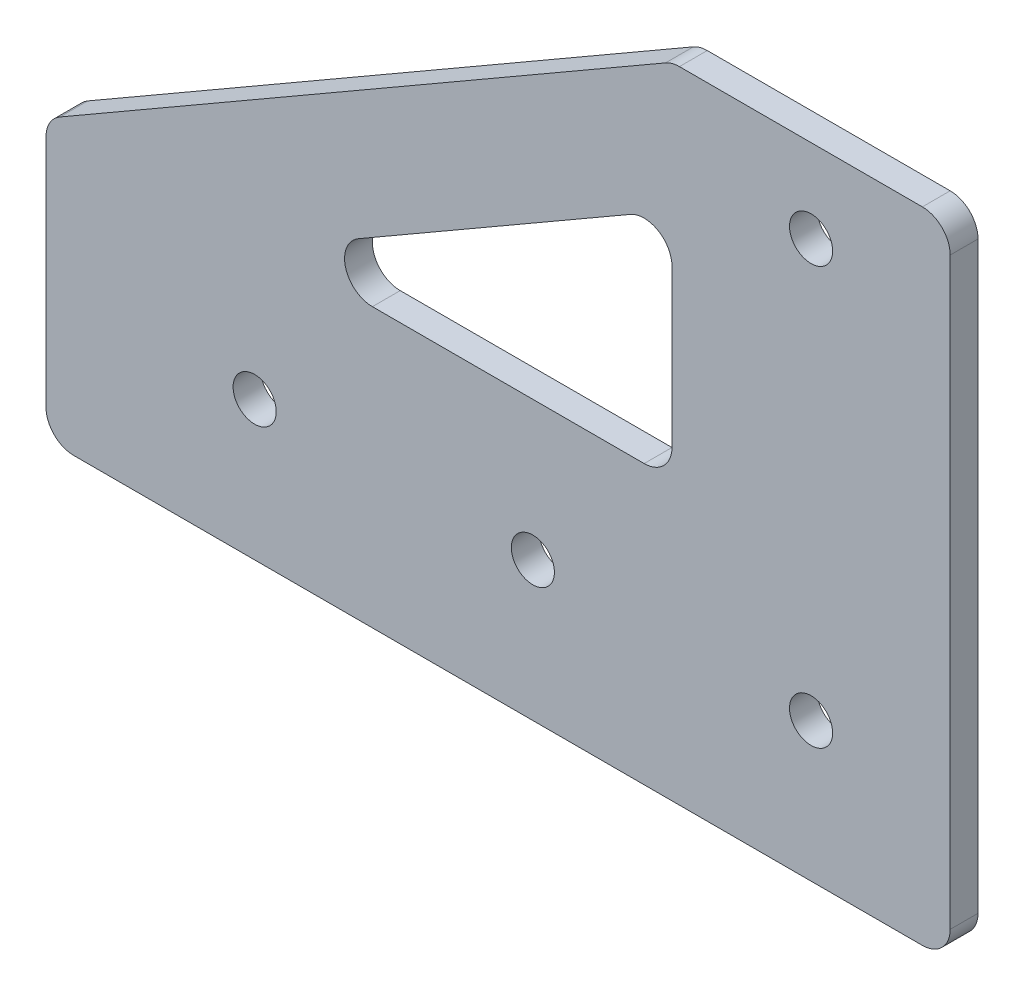
ISO-10303-21;
HEADER;
FILE_DESCRIPTION(('STEP AP214'),'2;1');
FILE_NAME('part.step','',(''),(''),'','','');
FILE_SCHEMA(('AUTOMOTIVE_DESIGN { 1 0 10303 214 1 1 1 1 }'));
ENDSEC;
DATA;
#1=APPLICATION_CONTEXT('core data for automotive mechanical design processes');
#2=APPLICATION_PROTOCOL_DEFINITION('international standard','automotive_design',2000,#1);
#3=PRODUCT_CONTEXT('',#1,'mechanical');
#4=PRODUCT('Part','Part','',(#3));
#5=PRODUCT_RELATED_PRODUCT_CATEGORY('part','',(#4));
#6=PRODUCT_DEFINITION_FORMATION('','',#4);
#7=PRODUCT_DEFINITION_CONTEXT('part definition',#1,'design');
#8=PRODUCT_DEFINITION('design','',#6,#7);
#9=PRODUCT_DEFINITION_SHAPE('','',#8);
#10=(LENGTH_UNIT() NAMED_UNIT(*) SI_UNIT(.MILLI.,.METRE.));
#11=(NAMED_UNIT(*) PLANE_ANGLE_UNIT() SI_UNIT($,.RADIAN.));
#12=(NAMED_UNIT(*) SI_UNIT($,.STERADIAN.) SOLID_ANGLE_UNIT());
#13=UNCERTAINTY_MEASURE_WITH_UNIT(LENGTH_MEASURE(1.E-05),#10,'distance_accuracy_value','');
#14=(GEOMETRIC_REPRESENTATION_CONTEXT(3) GLOBAL_UNCERTAINTY_ASSIGNED_CONTEXT((#13)) GLOBAL_UNIT_ASSIGNED_CONTEXT((#10,
#11,#12)) REPRESENTATION_CONTEXT('',''));
#15=CARTESIAN_POINT('',(0.,0.,0.));
#16=DIRECTION('',(0.,0.,1.));
#17=DIRECTION('',(1.,0.,0.));
#18=AXIS2_PLACEMENT_3D('',#15,#16,#17);
#19=CARTESIAN_POINT('',(-55.000000000003,-159.999999999997,2.));
#20=DIRECTION('',(1.,0.,0.));
#21=DIRECTION('',(0.,0.,-1.));
#22=AXIS2_PLACEMENT_3D('',#19,#20,#21);
#23=PLANE('',#22);
#24=DIRECTION('',(0.,-1.,0.));
#25=VECTOR('',#24,1.);
#26=CARTESIAN_POINT('',(-55.000000000003,-159.999999999997,2.));
#27=LINE('',#26,#25);
#28=CARTESIAN_POINT('',(-55.000000000003,-161.154700538376,2.));
#29=VERTEX_POINT('',#28);
#30=CARTESIAN_POINT('',(-55.000000000003,-177.999999999997,2.));
#31=VERTEX_POINT('',#30);
#32=EDGE_CURVE('E212',#29,#31,#27,.T.);
#33=ORIENTED_EDGE('',*,*,#32,.F.);
#34=DIRECTION('',(0.,0.,-1.));
#35=VECTOR('',#34,1.);
#36=CARTESIAN_POINT('',(-55.000000000003,-161.154700538376,2.));
#37=LINE('',#36,#35);
#38=CARTESIAN_POINT('',(-55.000000000003,-161.154700538376,0.));
#39=VERTEX_POINT('',#38);
#40=EDGE_CURVE('E240',#29,#39,#37,.T.);
#41=ORIENTED_EDGE('',*,*,#40,.T.);
#42=DIRECTION('',(0.,-1.,0.));
#43=VECTOR('',#42,1.);
#44=CARTESIAN_POINT('',(-55.000000000003,-159.999999999997,0.));
#45=LINE('',#44,#43);
#46=CARTESIAN_POINT('',(-55.000000000003,-177.999999999997,0.));
#47=VERTEX_POINT('',#46);
#48=EDGE_CURVE('E204',#39,#47,#45,.T.);
#49=ORIENTED_EDGE('',*,*,#48,.T.);
#50=DIRECTION('',(0.,0.,-1.));
#51=VECTOR('',#50,1.);
#52=CARTESIAN_POINT('',(-55.000000000003,-177.999999999997,2.));
#53=LINE('',#52,#51);
#54=EDGE_CURVE('E226',#47,#31,#53,.F.);
#55=ORIENTED_EDGE('',*,*,#54,.T.);
#56=EDGE_LOOP('',(#33,#41,#49,#55));
#57=FACE_BOUND('',#56,.T.);
#58=ADVANCED_FACE('F36',(#57),#23,.F.);
#59=CARTESIAN_POINT('',(-55.000000000003,-179.999999999997,2.));
#60=DIRECTION('',(0.,1.,0.));
#61=DIRECTION('',(0.,0.,1.));
#62=AXIS2_PLACEMENT_3D('',#59,#60,#61);
#63=PLANE('',#62);
#64=DIRECTION('',(1.,0.,0.));
#65=VECTOR('',#64,1.);
#66=CARTESIAN_POINT('',(-55.000000000003,-179.999999999997,0.));
#67=LINE('',#66,#65);
#68=CARTESIAN_POINT('',(-53.000000000003,-179.999999999997,0.));
#69=VERTEX_POINT('',#68);
#70=CARTESIAN_POINT('',(7.99999999999994,-179.999999999997,0.));
#71=VERTEX_POINT('',#70);
#72=EDGE_CURVE('E229',#69,#71,#67,.T.);
#73=ORIENTED_EDGE('',*,*,#72,.T.);
#74=DIRECTION('',(0.,0.,-1.));
#75=VECTOR('',#74,1.);
#76=CARTESIAN_POINT('',(7.99999999999994,-179.999999999997,2.));
#77=LINE('',#76,#75);
#78=CARTESIAN_POINT('',(7.99999999999994,-179.999999999997,2.));
#79=VERTEX_POINT('',#78);
#80=EDGE_CURVE('E275',#71,#79,#77,.F.);
#81=ORIENTED_EDGE('',*,*,#80,.T.);
#82=DIRECTION('',(1.,0.,0.));
#83=VECTOR('',#82,1.);
#84=CARTESIAN_POINT('',(-55.000000000003,-179.999999999997,2.));
#85=LINE('',#84,#83);
#86=CARTESIAN_POINT('',(-53.000000000003,-179.999999999997,2.));
#87=VERTEX_POINT('',#86);
#88=EDGE_CURVE('E215',#87,#79,#85,.T.);
#89=ORIENTED_EDGE('',*,*,#88,.F.);
#90=DIRECTION('',(0.,0.,-1.));
#91=VECTOR('',#90,1.);
#92=CARTESIAN_POINT('',(-53.000000000003,-179.999999999997,2.));
#93=LINE('',#92,#91);
#94=EDGE_CURVE('E272',#87,#69,#93,.T.);
#95=ORIENTED_EDGE('',*,*,#94,.T.);
#96=EDGE_LOOP('',(#73,#81,#89,#95));
#97=FACE_BOUND('',#96,.T.);
#98=ADVANCED_FACE('F308',(#97),#63,.F.);
#99=CARTESIAN_POINT('',(9.99999999999995,-179.999999999997,2.));
#100=DIRECTION('',(-1.,0.,0.));
#101=DIRECTION('',(0.,0.,1.));
#102=AXIS2_PLACEMENT_3D('',#99,#100,#101);
#103=PLANE('',#102);
#104=DIRECTION('',(0.,1.,0.));
#105=VECTOR('',#104,1.);
#106=CARTESIAN_POINT('',(9.99999999999995,-179.999999999997,2.));
#107=LINE('',#106,#105);
#108=CARTESIAN_POINT('',(9.99999999999995,-177.999999999997,2.));
#109=VERTEX_POINT('',#108);
#110=CARTESIAN_POINT('',(9.99999999999995,-136.019237886462,2.));
#111=VERTEX_POINT('',#110);
#112=EDGE_CURVE('E219',#109,#111,#107,.T.);
#113=ORIENTED_EDGE('',*,*,#112,.F.);
#114=DIRECTION('',(0.,0.,-1.));
#115=VECTOR('',#114,1.);
#116=CARTESIAN_POINT('',(9.99999999999995,-177.999999999997,2.));
#117=LINE('',#116,#115);
#118=CARTESIAN_POINT('',(9.99999999999995,-177.999999999997,0.));
#119=VERTEX_POINT('',#118);
#120=EDGE_CURVE('E269',#109,#119,#117,.T.);
#121=ORIENTED_EDGE('',*,*,#120,.T.);
#122=DIRECTION('',(0.,1.,0.));
#123=VECTOR('',#122,1.);
#124=CARTESIAN_POINT('',(9.99999999999995,-179.999999999997,0.));
#125=LINE('',#124,#123);
#126=CARTESIAN_POINT('',(9.99999999999995,-136.019237886462,0.));
#127=VERTEX_POINT('',#126);
#128=EDGE_CURVE('E232',#119,#127,#125,.T.);
#129=ORIENTED_EDGE('',*,*,#128,.T.);
#130=DIRECTION('',(0.,0.,-1.));
#131=VECTOR('',#130,1.);
#132=CARTESIAN_POINT('',(9.99999999999995,-136.019237886462,2.));
#133=LINE('',#132,#131);
#134=EDGE_CURVE('E267',#127,#111,#133,.F.);
#135=ORIENTED_EDGE('',*,*,#134,.T.);
#136=EDGE_LOOP('',(#113,#121,#129,#135));
#137=FACE_BOUND('',#136,.T.);
#138=ADVANCED_FACE('F316',(#137),#103,.F.);
#139=CARTESIAN_POINT('',(9.99999999999995,-134.019237886462,2.));
#140=DIRECTION('',(0.,-1.,0.));
#141=DIRECTION('',(0.,0.,-1.));
#142=AXIS2_PLACEMENT_3D('',#139,#140,#141);
#143=PLANE('',#142);
#144=DIRECTION('',(-1.,0.,0.));
#145=VECTOR('',#144,1.);
#146=CARTESIAN_POINT('',(9.99999999999995,-134.019237886462,0.));
#147=LINE('',#146,#145);
#148=CARTESIAN_POINT('',(7.99999999999995,-134.019237886462,0.));
#149=VERTEX_POINT('',#148);
#150=CARTESIAN_POINT('',(-9.4641016151378,-134.019237886462,0.));
#151=VERTEX_POINT('',#150);
#152=EDGE_CURVE('E235',#149,#151,#147,.T.);
#153=ORIENTED_EDGE('',*,*,#152,.T.);
#154=DIRECTION('',(0.,0.,-1.));
#155=VECTOR('',#154,1.);
#156=CARTESIAN_POINT('',(-9.4641016151378,-134.019237886462,2.));
#157=LINE('',#156,#155);
#158=CARTESIAN_POINT('',(-9.4641016151378,-134.019237886462,2.));
#159=VERTEX_POINT('',#158);
#160=EDGE_CURVE('E11',#151,#159,#157,.F.);
#161=ORIENTED_EDGE('',*,*,#160,.T.);
#162=DIRECTION('',(-1.,0.,0.));
#163=VECTOR('',#162,1.);
#164=CARTESIAN_POINT('',(9.99999999999995,-134.019237886462,2.));
#165=LINE('',#164,#163);
#166=CARTESIAN_POINT('',(7.99999999999995,-134.019237886462,2.));
#167=VERTEX_POINT('',#166);
#168=EDGE_CURVE('E221',#167,#159,#165,.T.);
#169=ORIENTED_EDGE('',*,*,#168,.F.);
#170=DIRECTION('',(0.,0.,-1.));
#171=VECTOR('',#170,1.);
#172=CARTESIAN_POINT('',(7.99999999999995,-134.019237886462,2.));
#173=LINE('',#172,#171);
#174=EDGE_CURVE('E44',#167,#149,#173,.T.);
#175=ORIENTED_EDGE('',*,*,#174,.T.);
#176=EDGE_LOOP('',(#153,#161,#169,#175));
#177=FACE_BOUND('',#176,.T.);
#178=ADVANCED_FACE('F279',(#177),#143,.F.);
#179=CARTESIAN_POINT('',(-10.0000000000001,-134.019237886462,2.));
#180=DIRECTION('',(0.5,-0.866025403784439,0.));
#181=DIRECTION('',(0.866025403784439,0.5,0.));
#182=AXIS2_PLACEMENT_3D('',#179,#180,#181);
#183=PLANE('',#182);
#184=DIRECTION('',(-0.866025403784439,-0.5,0.));
#185=VECTOR('',#184,1.);
#186=CARTESIAN_POINT('',(-10.0000000000001,-134.019237886462,0.));
#187=LINE('',#186,#185);
#188=CARTESIAN_POINT('',(-10.4641016151378,-134.287187078893,0.));
#189=VERTEX_POINT('',#188);
#190=CARTESIAN_POINT('',(-54.000000000003,-159.422649730807,0.));
#191=VERTEX_POINT('',#190);
#192=EDGE_CURVE('E216',#189,#191,#187,.T.);
#193=ORIENTED_EDGE('',*,*,#192,.T.);
#194=DIRECTION('',(0.,0.,-1.));
#195=VECTOR('',#194,1.);
#196=CARTESIAN_POINT('',(-54.000000000003,-159.422649730807,2.));
#197=LINE('',#196,#195);
#198=CARTESIAN_POINT('',(-54.000000000003,-159.422649730807,2.));
#199=VERTEX_POINT('',#198);
#200=EDGE_CURVE('E256',#191,#199,#197,.F.);
#201=ORIENTED_EDGE('',*,*,#200,.T.);
#202=DIRECTION('',(-0.866025403784439,-0.5,0.));
#203=VECTOR('',#202,1.);
#204=CARTESIAN_POINT('',(-10.0000000000001,-134.019237886462,2.));
#205=LINE('',#204,#203);
#206=CARTESIAN_POINT('',(-10.4641016151378,-134.287187078893,2.));
#207=VERTEX_POINT('',#206);
#208=EDGE_CURVE('E223',#207,#199,#205,.T.);
#209=ORIENTED_EDGE('',*,*,#208,.F.);
#210=DIRECTION('',(0.,0.,-1.));
#211=VECTOR('',#210,1.);
#212=CARTESIAN_POINT('',(-10.4641016151378,-134.287187078893,2.));
#213=LINE('',#212,#211);
#214=EDGE_CURVE('E253',#207,#189,#213,.T.);
#215=ORIENTED_EDGE('',*,*,#214,.T.);
#216=EDGE_LOOP('',(#193,#201,#209,#215));
#217=FACE_BOUND('',#216,.T.);
#218=ADVANCED_FACE('F292',(#217),#183,.F.);
#219=CARTESIAN_POINT('',(0.,0.,2.));
#220=DIRECTION('',(0.,0.,1.));
#221=DIRECTION('',(1.,0.,0.));
#222=AXIS2_PLACEMENT_3D('',#219,#220,#221);
#223=PLANE('',#222);
#224=CARTESIAN_POINT('',(1.72272612841695E-12,-139.999999999995,2.));
#225=DIRECTION('',(0.,0.,-1.));
#226=DIRECTION('',(0.,1.,0.));
#227=AXIS2_PLACEMENT_3D('',#224,#225,#226);
#228=CIRCLE('',#227,1.54999999999875);
#229=CARTESIAN_POINT('',(1.72272612841695E-12,-138.449999999996,2.));
#230=VERTEX_POINT('',#229);
#231=EDGE_CURVE('E513',#230,#230,#228,.T.);
#232=ORIENTED_EDGE('',*,*,#231,.T.);
#233=EDGE_LOOP('',(#232));
#234=FACE_BOUND('',#233,.T.);
#235=CARTESIAN_POINT('',(1.72272612841695E-12,-169.999999999995,2.));
#236=DIRECTION('',(0.,0.,-1.));
#237=DIRECTION('',(0.,1.,0.));
#238=AXIS2_PLACEMENT_3D('',#235,#236,#237);
#239=CIRCLE('',#238,1.54999999999875);
#240=CARTESIAN_POINT('',(1.72272612841695E-12,-168.449999999997,2.));
#241=VERTEX_POINT('',#240);
#242=EDGE_CURVE('E517',#241,#241,#239,.T.);
#243=ORIENTED_EDGE('',*,*,#242,.T.);
#244=EDGE_LOOP('',(#243));
#245=FACE_BOUND('',#244,.T.);
#246=CARTESIAN_POINT('',(-19.9999999999983,-169.999999999995,2.));
#247=DIRECTION('',(0.,0.,-1.));
#248=DIRECTION('',(0.,1.,0.));
#249=AXIS2_PLACEMENT_3D('',#246,#247,#248);
#250=CIRCLE('',#249,1.54999999999875);
#251=CARTESIAN_POINT('',(-19.9999999999983,-168.449999999996,2.));
#252=VERTEX_POINT('',#251);
#253=EDGE_CURVE('E521',#252,#252,#250,.T.);
#254=ORIENTED_EDGE('',*,*,#253,.T.);
#255=EDGE_LOOP('',(#254));
#256=FACE_BOUND('',#255,.T.);
#257=CARTESIAN_POINT('',(-39.9999999999951,-169.999999999995,2.));
#258=DIRECTION('',(0.,0.,-1.));
#259=DIRECTION('',(0.,1.,0.));
#260=AXIS2_PLACEMENT_3D('',#257,#258,#259);
#261=CIRCLE('',#260,1.54999999999969);
#262=CARTESIAN_POINT('',(-39.9999999999951,-168.449999999995,2.));
#263=VERTEX_POINT('',#262);
#264=EDGE_CURVE('E192',#263,#263,#261,.T.);
#265=ORIENTED_EDGE('',*,*,#264,.T.);
#266=EDGE_LOOP('',(#265));
#267=FACE_BOUND('',#266,.T.);
#268=CARTESIAN_POINT('',(-11.9999999999999,-157.999999999995,2.));
#269=DIRECTION('',(0.,0.,-1.));
#270=DIRECTION('',(0.,1.,0.));
#271=AXIS2_PLACEMENT_3D('',#268,#269,#270);
#272=CIRCLE('',#271,2.);
#273=CARTESIAN_POINT('',(-9.99999999999988,-157.999999999995,2.));
#274=VERTEX_POINT('',#273);
#275=CARTESIAN_POINT('',(-11.9999999999999,-159.999999999995,2.));
#276=VERTEX_POINT('',#275);
#277=EDGE_CURVE('E153',#274,#276,#272,.T.);
#278=ORIENTED_EDGE('',*,*,#277,.T.);
#279=DIRECTION('',(-1.,0.,0.));
#280=VECTOR('',#279,1.);
#281=CARTESIAN_POINT('',(-11.9999999999999,-159.999999999995,2.));
#282=LINE('',#281,#280);
#283=CARTESIAN_POINT('',(-31.5358983848622,-159.999999999995,2.));
#284=VERTEX_POINT('',#283);
#285=EDGE_CURVE('E165',#276,#284,#282,.T.);
#286=ORIENTED_EDGE('',*,*,#285,.T.);
#287=CARTESIAN_POINT('',(-31.5358983848622,-157.999999999995,2.));
#288=DIRECTION('',(0.,0.,-1.));
#289=DIRECTION('',(0.,1.,0.));
#290=AXIS2_PLACEMENT_3D('',#287,#288,#289);
#291=CIRCLE('',#290,2.);
#292=CARTESIAN_POINT('',(-32.5358983848622,-156.267949192426,2.));
#293=VERTEX_POINT('',#292);
#294=EDGE_CURVE('E169',#284,#293,#291,.T.);
#295=ORIENTED_EDGE('',*,*,#294,.T.);
#296=DIRECTION('',(0.866025403784439,0.5,0.));
#297=VECTOR('',#296,1.);
#298=CARTESIAN_POINT('',(-32.5358983848622,-156.267949192426,2.));
#299=LINE('',#298,#297);
#300=CARTESIAN_POINT('',(-12.9999999999999,-144.988893001065,2.));
#301=VERTEX_POINT('',#300);
#302=EDGE_CURVE('E184',#293,#301,#299,.T.);
#303=ORIENTED_EDGE('',*,*,#302,.T.);
#304=CARTESIAN_POINT('',(-11.9999999999999,-146.720943808634,2.));
#305=DIRECTION('',(0.,0.,-1.));
#306=DIRECTION('',(0.,1.,0.));
#307=AXIS2_PLACEMENT_3D('',#304,#305,#306);
#308=CIRCLE('',#307,2.);
#309=CARTESIAN_POINT('',(-9.99999999999987,-146.720943808634,2.));
#310=VERTEX_POINT('',#309);
#311=EDGE_CURVE('E187',#301,#310,#308,.T.);
#312=ORIENTED_EDGE('',*,*,#311,.T.);
#313=DIRECTION('',(0.,-1.,0.));
#314=VECTOR('',#313,1.);
#315=CARTESIAN_POINT('',(-9.99999999999988,-146.720943808634,2.));
#316=LINE('',#315,#314);
#317=EDGE_CURVE('E161',#310,#274,#316,.T.);
#318=ORIENTED_EDGE('',*,*,#317,.T.);
#319=EDGE_LOOP('',(#278,#286,#295,#303,#312,#318));
#320=FACE_BOUND('',#319,.T.);
#321=ORIENTED_EDGE('',*,*,#208,.T.);
#322=CARTESIAN_POINT('',(-53.000000000003,-161.154700538376,2.));
#323=DIRECTION('',(0.,0.,1.));
#324=DIRECTION('',(1.,0.,0.));
#325=AXIS2_PLACEMENT_3D('',#322,#323,#324);
#326=CIRCLE('',#325,2.);
#327=EDGE_CURVE('E265',#199,#29,#326,.T.);
#328=ORIENTED_EDGE('',*,*,#327,.T.);
#329=ORIENTED_EDGE('',*,*,#32,.T.);
#330=CARTESIAN_POINT('',(-53.000000000003,-177.999999999997,2.));
#331=DIRECTION('',(0.,0.,1.));
#332=DIRECTION('',(1.,0.,0.));
#333=AXIS2_PLACEMENT_3D('',#330,#331,#332);
#334=CIRCLE('',#333,2.);
#335=EDGE_CURVE('E261',#31,#87,#334,.T.);
#336=ORIENTED_EDGE('',*,*,#335,.T.);
#337=ORIENTED_EDGE('',*,*,#88,.T.);
#338=CARTESIAN_POINT('',(7.99999999999995,-177.999999999997,2.));
#339=DIRECTION('',(0.,0.,1.));
#340=DIRECTION('',(1.,0.,0.));
#341=AXIS2_PLACEMENT_3D('',#338,#339,#340);
#342=CIRCLE('',#341,2.);
#343=EDGE_CURVE('E263',#79,#109,#342,.T.);
#344=ORIENTED_EDGE('',*,*,#343,.T.);
#345=ORIENTED_EDGE('',*,*,#112,.T.);
#346=CARTESIAN_POINT('',(7.99999999999995,-136.019237886462,2.));
#347=DIRECTION('',(0.,0.,1.));
#348=DIRECTION('',(1.,0.,0.));
#349=AXIS2_PLACEMENT_3D('',#346,#347,#348);
#350=CIRCLE('',#349,2.);
#351=EDGE_CURVE('E56',#111,#167,#350,.T.);
#352=ORIENTED_EDGE('',*,*,#351,.T.);
#353=ORIENTED_EDGE('',*,*,#168,.T.);
#354=CARTESIAN_POINT('',(-9.4641016151378,-136.019237886462,2.));
#355=DIRECTION('',(0.,0.,1.));
#356=DIRECTION('',(1.,0.,0.));
#357=AXIS2_PLACEMENT_3D('',#354,#355,#356);
#358=CIRCLE('',#357,2.);
#359=EDGE_CURVE('E259',#159,#207,#358,.T.);
#360=ORIENTED_EDGE('',*,*,#359,.T.);
#361=EDGE_LOOP('',(#321,#328,#329,#336,#337,#344,#345,#352,#353,#360));
#362=FACE_BOUND('',#361,.T.);
#363=ADVANCED_FACE('F171',(#234,#245,#256,#267,#320,#362),#223,.T.);
#364=CARTESIAN_POINT('',(0.,0.,0.));
#365=DIRECTION('',(0.,0.,1.));
#366=DIRECTION('',(1.,0.,0.));
#367=AXIS2_PLACEMENT_3D('',#364,#365,#366);
#368=PLANE('',#367);
#369=CARTESIAN_POINT('',(1.72258041164497E-12,-139.999999999995,0.));
#370=DIRECTION('',(0.,0.,-1.));
#371=DIRECTION('',(0.,1.,0.));
#372=AXIS2_PLACEMENT_3D('',#369,#370,#371);
#373=CIRCLE('',#372,1.54999999999875);
#374=CARTESIAN_POINT('',(1.72258041164497E-12,-138.449999999996,0.));
#375=VERTEX_POINT('',#374);
#376=EDGE_CURVE('E180',#375,#375,#373,.T.);
#377=ORIENTED_EDGE('',*,*,#376,.F.);
#378=EDGE_LOOP('',(#377));
#379=FACE_BOUND('',#378,.T.);
#380=CARTESIAN_POINT('',(1.72258041164497E-12,-169.999999999995,0.));
#381=DIRECTION('',(0.,0.,-1.));
#382=DIRECTION('',(0.,1.,0.));
#383=AXIS2_PLACEMENT_3D('',#380,#381,#382);
#384=CIRCLE('',#383,1.54999999999875);
#385=CARTESIAN_POINT('',(1.72258041164497E-12,-168.449999999997,0.));
#386=VERTEX_POINT('',#385);
#387=EDGE_CURVE('E534',#386,#386,#384,.T.);
#388=ORIENTED_EDGE('',*,*,#387,.F.);
#389=EDGE_LOOP('',(#388));
#390=FACE_BOUND('',#389,.T.);
#391=CARTESIAN_POINT('',(-19.9999999999983,-169.999999999995,0.));
#392=DIRECTION('',(0.,0.,-1.));
#393=DIRECTION('',(0.,1.,0.));
#394=AXIS2_PLACEMENT_3D('',#391,#392,#393);
#395=CIRCLE('',#394,1.54999999999875);
#396=CARTESIAN_POINT('',(-19.9999999999983,-168.449999999996,0.));
#397=VERTEX_POINT('',#396);
#398=EDGE_CURVE('E530',#397,#397,#395,.T.);
#399=ORIENTED_EDGE('',*,*,#398,.F.);
#400=EDGE_LOOP('',(#399));
#401=FACE_BOUND('',#400,.T.);
#402=CARTESIAN_POINT('',(-39.9999999999951,-169.999999999995,0.));
#403=DIRECTION('',(0.,0.,-1.));
#404=DIRECTION('',(0.,1.,0.));
#405=AXIS2_PLACEMENT_3D('',#402,#403,#404);
#406=CIRCLE('',#405,1.54999999999969);
#407=CARTESIAN_POINT('',(-39.9999999999951,-168.449999999995,0.));
#408=VERTEX_POINT('',#407);
#409=EDGE_CURVE('E524',#408,#408,#406,.T.);
#410=ORIENTED_EDGE('',*,*,#409,.F.);
#411=EDGE_LOOP('',(#410));
#412=FACE_BOUND('',#411,.T.);
#413=DIRECTION('',(-1.,0.,0.));
#414=VECTOR('',#413,1.);
#415=CARTESIAN_POINT('',(-11.9999999999999,-159.999999999995,0.));
#416=LINE('',#415,#414);
#417=CARTESIAN_POINT('',(-11.9999999999999,-159.999999999995,0.));
#418=VERTEX_POINT('',#417);
#419=CARTESIAN_POINT('',(-31.5358983848622,-159.999999999995,0.));
#420=VERTEX_POINT('',#419);
#421=EDGE_CURVE('E191',#418,#420,#416,.T.);
#422=ORIENTED_EDGE('',*,*,#421,.F.);
#423=CARTESIAN_POINT('',(-11.9999999999999,-157.999999999995,0.));
#424=DIRECTION('',(0.,0.,-1.));
#425=DIRECTION('',(0.,1.,0.));
#426=AXIS2_PLACEMENT_3D('',#423,#424,#425);
#427=CIRCLE('',#426,2.);
#428=CARTESIAN_POINT('',(-9.99999999999988,-157.999999999995,0.));
#429=VERTEX_POINT('',#428);
#430=EDGE_CURVE('E156',#429,#418,#427,.T.);
#431=ORIENTED_EDGE('',*,*,#430,.F.);
#432=DIRECTION('',(0.,-1.,0.));
#433=VECTOR('',#432,1.);
#434=CARTESIAN_POINT('',(-9.99999999999988,-146.720943808634,0.));
#435=LINE('',#434,#433);
#436=CARTESIAN_POINT('',(-9.99999999999987,-146.720943808634,0.));
#437=VERTEX_POINT('',#436);
#438=EDGE_CURVE('E174',#437,#429,#435,.T.);
#439=ORIENTED_EDGE('',*,*,#438,.F.);
#440=CARTESIAN_POINT('',(-11.9999999999999,-146.720943808634,0.));
#441=DIRECTION('',(0.,0.,-1.));
#442=DIRECTION('',(0.,1.,0.));
#443=AXIS2_PLACEMENT_3D('',#440,#441,#442);
#444=CIRCLE('',#443,2.);
#445=CARTESIAN_POINT('',(-12.9999999999999,-144.988893001065,0.));
#446=VERTEX_POINT('',#445);
#447=EDGE_CURVE('E177',#446,#437,#444,.T.);
#448=ORIENTED_EDGE('',*,*,#447,.F.);
#449=DIRECTION('',(0.866025403784439,0.5,0.));
#450=VECTOR('',#449,1.);
#451=CARTESIAN_POINT('',(-32.5358983848622,-156.267949192426,0.));
#452=LINE('',#451,#450);
#453=CARTESIAN_POINT('',(-32.5358983848622,-156.267949192426,0.));
#454=VERTEX_POINT('',#453);
#455=EDGE_CURVE('E197',#454,#446,#452,.T.);
#456=ORIENTED_EDGE('',*,*,#455,.F.);
#457=CARTESIAN_POINT('',(-31.5358983848622,-157.999999999995,0.));
#458=DIRECTION('',(0.,0.,-1.));
#459=DIRECTION('',(0.,1.,0.));
#460=AXIS2_PLACEMENT_3D('',#457,#458,#459);
#461=CIRCLE('',#460,2.);
#462=EDGE_CURVE('E194',#420,#454,#461,.T.);
#463=ORIENTED_EDGE('',*,*,#462,.F.);
#464=EDGE_LOOP('',(#422,#431,#439,#448,#456,#463));
#465=FACE_BOUND('',#464,.T.);
#466=ORIENTED_EDGE('',*,*,#48,.F.);
#467=CARTESIAN_POINT('',(-53.000000000003,-161.154700538376,0.));
#468=DIRECTION('',(0.,0.,1.));
#469=DIRECTION('',(1.,0.,0.));
#470=AXIS2_PLACEMENT_3D('',#467,#468,#469);
#471=CIRCLE('',#470,2.);
#472=EDGE_CURVE('E251',#39,#191,#471,.F.);
#473=ORIENTED_EDGE('',*,*,#472,.T.);
#474=ORIENTED_EDGE('',*,*,#192,.F.);
#475=CARTESIAN_POINT('',(-9.4641016151378,-136.019237886462,0.));
#476=DIRECTION('',(0.,0.,1.));
#477=DIRECTION('',(1.,0.,0.));
#478=AXIS2_PLACEMENT_3D('',#475,#476,#477);
#479=CIRCLE('',#478,2.);
#480=EDGE_CURVE('E245',#189,#151,#479,.F.);
#481=ORIENTED_EDGE('',*,*,#480,.T.);
#482=ORIENTED_EDGE('',*,*,#152,.F.);
#483=CARTESIAN_POINT('',(7.99999999999995,-136.019237886462,0.));
#484=DIRECTION('',(0.,0.,1.));
#485=DIRECTION('',(1.,0.,0.));
#486=AXIS2_PLACEMENT_3D('',#483,#484,#485);
#487=CIRCLE('',#486,2.);
#488=EDGE_CURVE('E243',#149,#127,#487,.F.);
#489=ORIENTED_EDGE('',*,*,#488,.T.);
#490=ORIENTED_EDGE('',*,*,#128,.F.);
#491=CARTESIAN_POINT('',(7.99999999999995,-177.999999999997,0.));
#492=DIRECTION('',(0.,0.,1.));
#493=DIRECTION('',(1.,0.,0.));
#494=AXIS2_PLACEMENT_3D('',#491,#492,#493);
#495=CIRCLE('',#494,2.);
#496=EDGE_CURVE('E249',#119,#71,#495,.F.);
#497=ORIENTED_EDGE('',*,*,#496,.T.);
#498=ORIENTED_EDGE('',*,*,#72,.F.);
#499=CARTESIAN_POINT('',(-53.000000000003,-177.999999999997,0.));
#500=DIRECTION('',(0.,0.,1.));
#501=DIRECTION('',(1.,0.,0.));
#502=AXIS2_PLACEMENT_3D('',#499,#500,#501);
#503=CIRCLE('',#502,2.);
#504=EDGE_CURVE('E247',#69,#47,#503,.F.);
#505=ORIENTED_EDGE('',*,*,#504,.T.);
#506=EDGE_LOOP('',(#466,#473,#474,#481,#482,#489,#490,#497,#498,#505));
#507=FACE_BOUND('',#506,.T.);
#508=ADVANCED_FACE('F283',(#379,#390,#401,#412,#465,#507),#368,.F.);
#509=CARTESIAN_POINT('',(-11.9999999999999,-157.999999999995,2.));
#510=DIRECTION('',(0.,0.,-1.));
#511=DIRECTION('',(0.,1.,0.));
#512=AXIS2_PLACEMENT_3D('',#509,#510,#511);
#513=CYLINDRICAL_SURFACE('',#512,2.);
#514=ORIENTED_EDGE('',*,*,#430,.T.);
#515=DIRECTION('',(0.,0.,-1.));
#516=VECTOR('',#515,1.);
#517=CARTESIAN_POINT('',(-11.9999999999999,-159.999999999995,2.));
#518=LINE('',#517,#516);
#519=EDGE_CURVE('E149',#276,#418,#518,.T.);
#520=ORIENTED_EDGE('',*,*,#519,.F.);
#521=ORIENTED_EDGE('',*,*,#277,.F.);
#522=DIRECTION('',(0.,0.,-1.));
#523=VECTOR('',#522,1.);
#524=CARTESIAN_POINT('',(-9.99999999999988,-157.999999999995,2.));
#525=LINE('',#524,#523);
#526=EDGE_CURVE('E202',#274,#429,#525,.T.);
#527=ORIENTED_EDGE('',*,*,#526,.T.);
#528=EDGE_LOOP('',(#514,#520,#521,#527));
#529=FACE_BOUND('',#528,.T.);
#530=ADVANCED_FACE('F151',(#529),#513,.F.);
#531=CARTESIAN_POINT('',(-9.99999999999988,-146.720943808634,2.));
#532=DIRECTION('',(1.,0.,0.));
#533=DIRECTION('',(0.,0.,-1.));
#534=AXIS2_PLACEMENT_3D('',#531,#532,#533);
#535=PLANE('',#534);
#536=ORIENTED_EDGE('',*,*,#438,.T.);
#537=ORIENTED_EDGE('',*,*,#526,.F.);
#538=ORIENTED_EDGE('',*,*,#317,.F.);
#539=DIRECTION('',(0.,0.,-1.));
#540=VECTOR('',#539,1.);
#541=CARTESIAN_POINT('',(-9.99999999999987,-146.720943808634,2.));
#542=LINE('',#541,#540);
#543=EDGE_CURVE('E205',#310,#437,#542,.T.);
#544=ORIENTED_EDGE('',*,*,#543,.T.);
#545=EDGE_LOOP('',(#536,#537,#538,#544));
#546=FACE_BOUND('',#545,.T.);
#547=ADVANCED_FACE('F431',(#546),#535,.F.);
#548=CARTESIAN_POINT('',(-11.9999999999999,-146.720943808634,2.));
#549=DIRECTION('',(0.,0.,-1.));
#550=DIRECTION('',(0.,1.,0.));
#551=AXIS2_PLACEMENT_3D('',#548,#549,#550);
#552=CYLINDRICAL_SURFACE('',#551,2.);
#553=ORIENTED_EDGE('',*,*,#447,.T.);
#554=ORIENTED_EDGE('',*,*,#543,.F.);
#555=ORIENTED_EDGE('',*,*,#311,.F.);
#556=DIRECTION('',(0.,0.,-1.));
#557=VECTOR('',#556,1.);
#558=CARTESIAN_POINT('',(-12.9999999999999,-144.988893001065,2.));
#559=LINE('',#558,#557);
#560=EDGE_CURVE('E207',#301,#446,#559,.T.);
#561=ORIENTED_EDGE('',*,*,#560,.T.);
#562=EDGE_LOOP('',(#553,#554,#555,#561));
#563=FACE_BOUND('',#562,.T.);
#564=ADVANCED_FACE('F422',(#563),#552,.F.);
#565=CARTESIAN_POINT('',(-32.5358983848622,-156.267949192426,2.));
#566=DIRECTION('',(-0.5,0.866025403784439,0.));
#567=DIRECTION('',(-0.866025403784439,-0.5,0.));
#568=AXIS2_PLACEMENT_3D('',#565,#566,#567);
#569=PLANE('',#568);
#570=ORIENTED_EDGE('',*,*,#455,.T.);
#571=ORIENTED_EDGE('',*,*,#560,.F.);
#572=ORIENTED_EDGE('',*,*,#302,.F.);
#573=DIRECTION('',(0.,0.,-1.));
#574=VECTOR('',#573,1.);
#575=CARTESIAN_POINT('',(-32.5358983848622,-156.267949192426,2.));
#576=LINE('',#575,#574);
#577=EDGE_CURVE('E209',#293,#454,#576,.T.);
#578=ORIENTED_EDGE('',*,*,#577,.T.);
#579=EDGE_LOOP('',(#570,#571,#572,#578));
#580=FACE_BOUND('',#579,.T.);
#581=ADVANCED_FACE('F413',(#580),#569,.F.);
#582=CARTESIAN_POINT('',(-31.5358983848622,-157.999999999995,2.));
#583=DIRECTION('',(0.,0.,-1.));
#584=DIRECTION('',(0.,1.,0.));
#585=AXIS2_PLACEMENT_3D('',#582,#583,#584);
#586=CYLINDRICAL_SURFACE('',#585,2.);
#587=ORIENTED_EDGE('',*,*,#462,.T.);
#588=ORIENTED_EDGE('',*,*,#577,.F.);
#589=ORIENTED_EDGE('',*,*,#294,.F.);
#590=DIRECTION('',(0.,0.,-1.));
#591=VECTOR('',#590,1.);
#592=CARTESIAN_POINT('',(-31.5358983848622,-159.999999999995,2.));
#593=LINE('',#592,#591);
#594=EDGE_CURVE('E160',#284,#420,#593,.T.);
#595=ORIENTED_EDGE('',*,*,#594,.T.);
#596=EDGE_LOOP('',(#587,#588,#589,#595));
#597=FACE_BOUND('',#596,.T.);
#598=ADVANCED_FACE('F405',(#597),#586,.F.);
#599=CARTESIAN_POINT('',(-11.9999999999999,-159.999999999995,2.));
#600=DIRECTION('',(0.,-1.,0.));
#601=DIRECTION('',(0.,0.,-1.));
#602=AXIS2_PLACEMENT_3D('',#599,#600,#601);
#603=PLANE('',#602);
#604=ORIENTED_EDGE('',*,*,#421,.T.);
#605=ORIENTED_EDGE('',*,*,#594,.F.);
#606=ORIENTED_EDGE('',*,*,#285,.F.);
#607=ORIENTED_EDGE('',*,*,#519,.T.);
#608=EDGE_LOOP('',(#604,#605,#606,#607));
#609=FACE_BOUND('',#608,.T.);
#610=ADVANCED_FACE('F166',(#609),#603,.F.);
#611=CARTESIAN_POINT('',(-39.9999999999951,-169.999999999995,2.));
#612=DIRECTION('',(0.,0.,-1.));
#613=DIRECTION('',(0.,1.,0.));
#614=AXIS2_PLACEMENT_3D('',#611,#612,#613);
#615=CYLINDRICAL_SURFACE('',#614,1.54999999999969);
#616=ORIENTED_EDGE('',*,*,#264,.F.);
#617=EDGE_LOOP('',(#616));
#618=FACE_BOUND('',#617,.T.);
#619=ORIENTED_EDGE('',*,*,#409,.T.);
#620=EDGE_LOOP('',(#619));
#621=FACE_BOUND('',#620,.T.);
#622=ADVANCED_FACE('F388',(#618,#621),#615,.F.);
#623=CARTESIAN_POINT('',(-19.9999999999983,-169.999999999995,2.));
#624=DIRECTION('',(0.,0.,-1.));
#625=DIRECTION('',(0.,1.,0.));
#626=AXIS2_PLACEMENT_3D('',#623,#624,#625);
#627=CYLINDRICAL_SURFACE('',#626,1.54999999999875);
#628=ORIENTED_EDGE('',*,*,#253,.F.);
#629=EDGE_LOOP('',(#628));
#630=FACE_BOUND('',#629,.T.);
#631=ORIENTED_EDGE('',*,*,#398,.T.);
#632=EDGE_LOOP('',(#631));
#633=FACE_BOUND('',#632,.T.);
#634=ADVANCED_FACE('F379',(#630,#633),#627,.F.);
#635=CARTESIAN_POINT('',(1.72272612841695E-12,-169.999999999995,2.));
#636=DIRECTION('',(0.,0.,-1.));
#637=DIRECTION('',(0.,1.,0.));
#638=AXIS2_PLACEMENT_3D('',#635,#636,#637);
#639=CYLINDRICAL_SURFACE('',#638,1.54999999999875);
#640=ORIENTED_EDGE('',*,*,#242,.F.);
#641=EDGE_LOOP('',(#640));
#642=FACE_BOUND('',#641,.T.);
#643=ORIENTED_EDGE('',*,*,#387,.T.);
#644=EDGE_LOOP('',(#643));
#645=FACE_BOUND('',#644,.T.);
#646=ADVANCED_FACE('F370',(#642,#645),#639,.F.);
#647=CARTESIAN_POINT('',(1.72272612841695E-12,-139.999999999995,2.));
#648=DIRECTION('',(0.,0.,-1.));
#649=DIRECTION('',(0.,1.,0.));
#650=AXIS2_PLACEMENT_3D('',#647,#648,#649);
#651=CYLINDRICAL_SURFACE('',#650,1.54999999999875);
#652=ORIENTED_EDGE('',*,*,#231,.F.);
#653=EDGE_LOOP('',(#652));
#654=FACE_BOUND('',#653,.T.);
#655=ORIENTED_EDGE('',*,*,#376,.T.);
#656=EDGE_LOOP('',(#655));
#657=FACE_BOUND('',#656,.T.);
#658=ADVANCED_FACE('F332',(#654,#657),#651,.F.);
#659=CARTESIAN_POINT('',(-53.000000000003,-161.154700538376,2.));
#660=DIRECTION('',(0.,0.,-1.));
#661=DIRECTION('',(-1.,0.,0.));
#662=AXIS2_PLACEMENT_3D('',#659,#660,#661);
#663=CYLINDRICAL_SURFACE('',#662,2.);
#664=ORIENTED_EDGE('',*,*,#327,.F.);
#665=ORIENTED_EDGE('',*,*,#200,.F.);
#666=ORIENTED_EDGE('',*,*,#472,.F.);
#667=ORIENTED_EDGE('',*,*,#40,.F.);
#668=EDGE_LOOP('',(#664,#665,#666,#667));
#669=FACE_BOUND('',#668,.T.);
#670=ADVANCED_FACE('F298',(#669),#663,.T.);
#671=CARTESIAN_POINT('',(7.99999999999995,-177.999999999997,2.));
#672=DIRECTION('',(0.,0.,-1.));
#673=DIRECTION('',(-1.,0.,0.));
#674=AXIS2_PLACEMENT_3D('',#671,#672,#673);
#675=CYLINDRICAL_SURFACE('',#674,2.);
#676=ORIENTED_EDGE('',*,*,#343,.F.);
#677=ORIENTED_EDGE('',*,*,#80,.F.);
#678=ORIENTED_EDGE('',*,*,#496,.F.);
#679=ORIENTED_EDGE('',*,*,#120,.F.);
#680=EDGE_LOOP('',(#676,#677,#678,#679));
#681=FACE_BOUND('',#680,.T.);
#682=ADVANCED_FACE('F314',(#681),#675,.T.);
#683=CARTESIAN_POINT('',(-53.000000000003,-177.999999999997,2.));
#684=DIRECTION('',(0.,0.,-1.));
#685=DIRECTION('',(-1.,0.,0.));
#686=AXIS2_PLACEMENT_3D('',#683,#684,#685);
#687=CYLINDRICAL_SURFACE('',#686,2.);
#688=ORIENTED_EDGE('',*,*,#335,.F.);
#689=ORIENTED_EDGE('',*,*,#54,.F.);
#690=ORIENTED_EDGE('',*,*,#504,.F.);
#691=ORIENTED_EDGE('',*,*,#94,.F.);
#692=EDGE_LOOP('',(#688,#689,#690,#691));
#693=FACE_BOUND('',#692,.T.);
#694=ADVANCED_FACE('F305',(#693),#687,.T.);
#695=CARTESIAN_POINT('',(-9.4641016151378,-136.019237886462,2.));
#696=DIRECTION('',(0.,0.,-1.));
#697=DIRECTION('',(-1.,0.,0.));
#698=AXIS2_PLACEMENT_3D('',#695,#696,#697);
#699=CYLINDRICAL_SURFACE('',#698,2.);
#700=ORIENTED_EDGE('',*,*,#359,.F.);
#701=ORIENTED_EDGE('',*,*,#160,.F.);
#702=ORIENTED_EDGE('',*,*,#480,.F.);
#703=ORIENTED_EDGE('',*,*,#214,.F.);
#704=EDGE_LOOP('',(#700,#701,#702,#703));
#705=FACE_BOUND('',#704,.T.);
#706=ADVANCED_FACE('F289',(#705),#699,.T.);
#707=CARTESIAN_POINT('',(7.99999999999995,-136.019237886462,2.));
#708=DIRECTION('',(0.,0.,-1.));
#709=DIRECTION('',(-1.,0.,0.));
#710=AXIS2_PLACEMENT_3D('',#707,#708,#709);
#711=CYLINDRICAL_SURFACE('',#710,2.);
#712=ORIENTED_EDGE('',*,*,#351,.F.);
#713=ORIENTED_EDGE('',*,*,#134,.F.);
#714=ORIENTED_EDGE('',*,*,#488,.F.);
#715=ORIENTED_EDGE('',*,*,#174,.F.);
#716=EDGE_LOOP('',(#712,#713,#714,#715));
#717=FACE_BOUND('',#716,.T.);
#718=ADVANCED_FACE('F38',(#717),#711,.T.);
#719=CLOSED_SHELL('',(#58,#98,#138,#178,#218,#363,#508,#530,#547,#564,#581,#598,#610,#622,#634,
#646,#658,#670,#682,#694,#706,#718));
#720=MANIFOLD_SOLID_BREP('B2',#719);
#721=ADVANCED_BREP_SHAPE_REPRESENTATION('',(#18,#720),#14);
#722=SHAPE_DEFINITION_REPRESENTATION(#9,#721);
ENDSEC;
END-ISO-10303-21;
